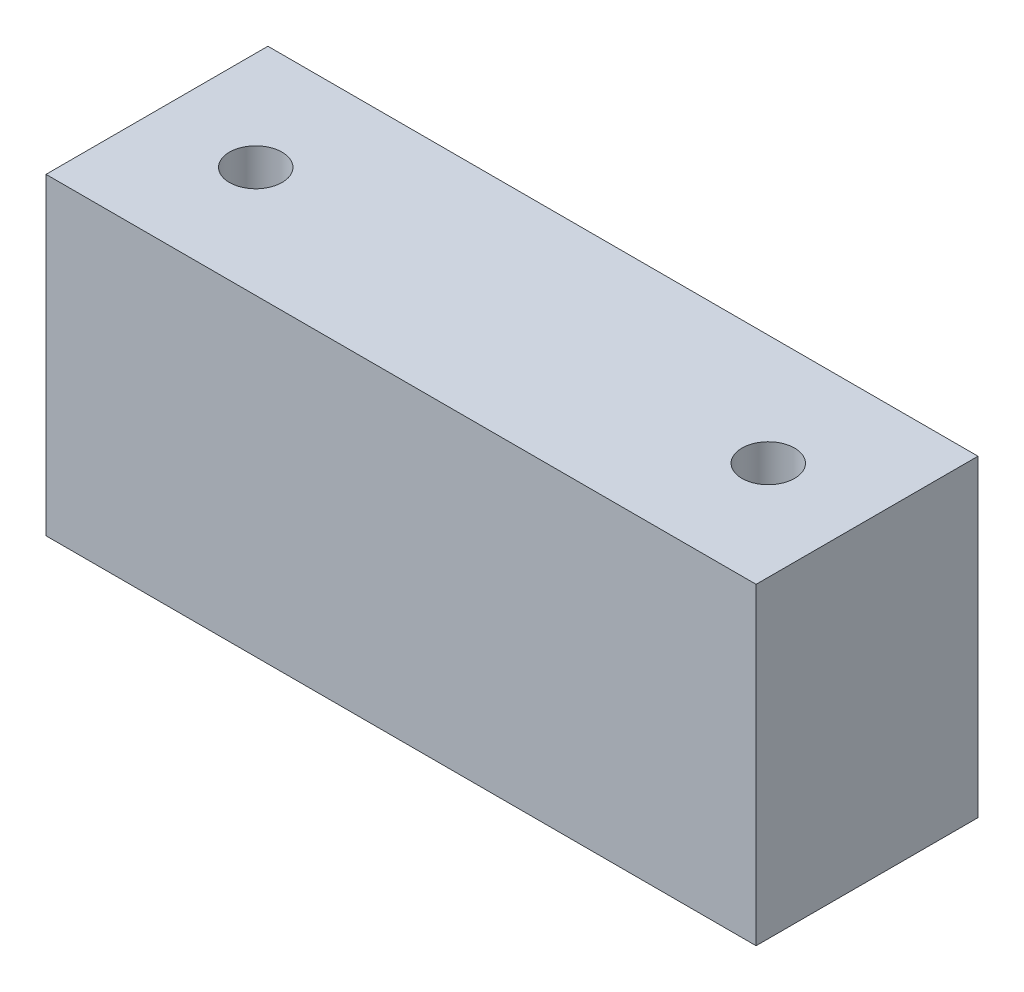
ISO-10303-21;
HEADER;
FILE_DESCRIPTION(('STEP AP214'),'2;1');
FILE_NAME('part.step','',(''),(''),'','','');
FILE_SCHEMA(('AUTOMOTIVE_DESIGN { 1 0 10303 214 1 1 1 1 }'));
ENDSEC;
DATA;
#1=APPLICATION_CONTEXT('core data for automotive mechanical design processes');
#2=APPLICATION_PROTOCOL_DEFINITION('international standard','automotive_design',2000,#1);
#3=PRODUCT_CONTEXT('',#1,'mechanical');
#4=PRODUCT('Part','Part','',(#3));
#5=PRODUCT_RELATED_PRODUCT_CATEGORY('part','',(#4));
#6=PRODUCT_DEFINITION_FORMATION('','',#4);
#7=PRODUCT_DEFINITION_CONTEXT('part definition',#1,'design');
#8=PRODUCT_DEFINITION('design','',#6,#7);
#9=PRODUCT_DEFINITION_SHAPE('','',#8);
#10=(LENGTH_UNIT() NAMED_UNIT(*) SI_UNIT(.MILLI.,.METRE.));
#11=(NAMED_UNIT(*) PLANE_ANGLE_UNIT() SI_UNIT($,.RADIAN.));
#12=(NAMED_UNIT(*) SI_UNIT($,.STERADIAN.) SOLID_ANGLE_UNIT());
#13=UNCERTAINTY_MEASURE_WITH_UNIT(LENGTH_MEASURE(1.E-05),#10,'distance_accuracy_value','');
#14=(GEOMETRIC_REPRESENTATION_CONTEXT(3) GLOBAL_UNCERTAINTY_ASSIGNED_CONTEXT((#13)) GLOBAL_UNIT_ASSIGNED_CONTEXT((#10,
#11,#12)) REPRESENTATION_CONTEXT('',''));
#15=CARTESIAN_POINT('',(0.,0.,0.));
#16=DIRECTION('',(0.,0.,1.));
#17=DIRECTION('',(1.,0.,0.));
#18=AXIS2_PLACEMENT_3D('',#15,#16,#17);
#19=CARTESIAN_POINT('',(15.24,13.4366,4.7625));
#20=DIRECTION('',(-1.,0.,0.));
#21=DIRECTION('',(0.,0.,1.));
#22=AXIS2_PLACEMENT_3D('',#19,#20,#21);
#23=PLANE('',#22);
#24=DIRECTION('',(0.,0.,-1.));
#25=VECTOR('',#24,1.);
#26=CARTESIAN_POINT('',(15.24,0.,4.7625));
#27=LINE('',#26,#25);
#28=CARTESIAN_POINT('',(15.24,0.,4.7625));
#29=VERTEX_POINT('',#28);
#30=CARTESIAN_POINT('',(15.24,0.,-4.7625));
#31=VERTEX_POINT('',#30);
#32=EDGE_CURVE('E111',#29,#31,#27,.T.);
#33=ORIENTED_EDGE('',*,*,#32,.T.);
#34=DIRECTION('',(0.,-1.,0.));
#35=VECTOR('',#34,1.);
#36=CARTESIAN_POINT('',(15.24,13.4366,-4.7625));
#37=LINE('',#36,#35);
#38=CARTESIAN_POINT('',(15.24,13.4366,-4.7625));
#39=VERTEX_POINT('',#38);
#40=EDGE_CURVE('E11',#39,#31,#37,.T.);
#41=ORIENTED_EDGE('',*,*,#40,.F.);
#42=DIRECTION('',(0.,0.,-1.));
#43=VECTOR('',#42,1.);
#44=CARTESIAN_POINT('',(15.24,13.4366,4.7625));
#45=LINE('',#44,#43);
#46=CARTESIAN_POINT('',(15.24,13.4366,4.7625));
#47=VERTEX_POINT('',#46);
#48=EDGE_CURVE('E95',#47,#39,#45,.T.);
#49=ORIENTED_EDGE('',*,*,#48,.F.);
#50=DIRECTION('',(0.,-1.,0.));
#51=VECTOR('',#50,1.);
#52=CARTESIAN_POINT('',(15.24,13.4366,4.7625));
#53=LINE('',#52,#51);
#54=EDGE_CURVE('E107',#47,#29,#53,.T.);
#55=ORIENTED_EDGE('',*,*,#54,.T.);
#56=EDGE_LOOP('',(#33,#41,#49,#55));
#57=FACE_BOUND('',#56,.T.);
#58=ADVANCED_FACE('F43',(#57),#23,.F.);
#59=CARTESIAN_POINT('',(-15.24,13.4366,-4.7625));
#60=DIRECTION('',(0.,0.,1.));
#61=DIRECTION('',(1.,0.,0.));
#62=AXIS2_PLACEMENT_3D('',#59,#60,#61);
#63=PLANE('',#62);
#64=DIRECTION('',(-1.,0.,0.));
#65=VECTOR('',#64,1.);
#66=CARTESIAN_POINT('',(-15.24,0.,-4.7625));
#67=LINE('',#66,#65);
#68=CARTESIAN_POINT('',(-15.24,0.,-4.7625));
#69=VERTEX_POINT('',#68);
#70=EDGE_CURVE('E100',#31,#69,#67,.T.);
#71=ORIENTED_EDGE('',*,*,#70,.T.);
#72=DIRECTION('',(0.,-1.,0.));
#73=VECTOR('',#72,1.);
#74=CARTESIAN_POINT('',(-15.24,13.4366,-4.7625));
#75=LINE('',#74,#73);
#76=CARTESIAN_POINT('',(-15.24,13.4366,-4.7625));
#77=VERTEX_POINT('',#76);
#78=EDGE_CURVE('E52',#77,#69,#75,.T.);
#79=ORIENTED_EDGE('',*,*,#78,.F.);
#80=DIRECTION('',(-1.,0.,0.));
#81=VECTOR('',#80,1.);
#82=CARTESIAN_POINT('',(-15.24,13.4366,-4.7625));
#83=LINE('',#82,#81);
#84=EDGE_CURVE('E90',#39,#77,#83,.T.);
#85=ORIENTED_EDGE('',*,*,#84,.F.);
#86=ORIENTED_EDGE('',*,*,#40,.T.);
#87=EDGE_LOOP('',(#71,#79,#85,#86));
#88=FACE_BOUND('',#87,.T.);
#89=ADVANCED_FACE('F99',(#88),#63,.F.);
#90=CARTESIAN_POINT('',(-15.24,13.4366,4.7625));
#91=DIRECTION('',(1.,0.,0.));
#92=DIRECTION('',(0.,0.,-1.));
#93=AXIS2_PLACEMENT_3D('',#90,#91,#92);
#94=PLANE('',#93);
#95=DIRECTION('',(0.,0.,1.));
#96=VECTOR('',#95,1.);
#97=CARTESIAN_POINT('',(-15.24,0.,4.7625));
#98=LINE('',#97,#96);
#99=CARTESIAN_POINT('',(-15.24,0.,4.7625));
#100=VERTEX_POINT('',#99);
#101=EDGE_CURVE('E77',#69,#100,#98,.T.);
#102=ORIENTED_EDGE('',*,*,#101,.T.);
#103=DIRECTION('',(0.,-1.,0.));
#104=VECTOR('',#103,1.);
#105=CARTESIAN_POINT('',(-15.24,13.4366,4.7625));
#106=LINE('',#105,#104);
#107=CARTESIAN_POINT('',(-15.24,13.4366,4.7625));
#108=VERTEX_POINT('',#107);
#109=EDGE_CURVE('E102',#108,#100,#106,.T.);
#110=ORIENTED_EDGE('',*,*,#109,.F.);
#111=DIRECTION('',(0.,0.,1.));
#112=VECTOR('',#111,1.);
#113=CARTESIAN_POINT('',(-15.24,13.4366,4.7625));
#114=LINE('',#113,#112);
#115=EDGE_CURVE('E93',#77,#108,#114,.T.);
#116=ORIENTED_EDGE('',*,*,#115,.F.);
#117=ORIENTED_EDGE('',*,*,#78,.T.);
#118=EDGE_LOOP('',(#102,#110,#116,#117));
#119=FACE_BOUND('',#118,.T.);
#120=ADVANCED_FACE('F103',(#119),#94,.F.);
#121=CARTESIAN_POINT('',(-15.24,13.4366,4.7625));
#122=DIRECTION('',(0.,0.,-1.));
#123=DIRECTION('',(-1.,0.,0.));
#124=AXIS2_PLACEMENT_3D('',#121,#122,#123);
#125=PLANE('',#124);
#126=DIRECTION('',(1.,0.,0.));
#127=VECTOR('',#126,1.);
#128=CARTESIAN_POINT('',(-15.24,0.,4.7625));
#129=LINE('',#128,#127);
#130=EDGE_CURVE('E83',#100,#29,#129,.T.);
#131=ORIENTED_EDGE('',*,*,#130,.T.);
#132=ORIENTED_EDGE('',*,*,#54,.F.);
#133=DIRECTION('',(1.,0.,0.));
#134=VECTOR('',#133,1.);
#135=CARTESIAN_POINT('',(-15.24,13.4366,4.7625));
#136=LINE('',#135,#134);
#137=EDGE_CURVE('E60',#108,#47,#136,.T.);
#138=ORIENTED_EDGE('',*,*,#137,.F.);
#139=ORIENTED_EDGE('',*,*,#109,.T.);
#140=EDGE_LOOP('',(#131,#132,#138,#139));
#141=FACE_BOUND('',#140,.T.);
#142=ADVANCED_FACE('F125',(#141),#125,.F.);
#143=CARTESIAN_POINT('',(0.,13.4366,0.));
#144=DIRECTION('',(0.,-1.,0.));
#145=DIRECTION('',(0.,0.,-1.));
#146=AXIS2_PLACEMENT_3D('',#143,#144,#145);
#147=PLANE('',#146);
#148=CARTESIAN_POINT('',(-11.,13.4366,0.));
#149=DIRECTION('',(0.,1.,0.));
#150=DIRECTION('',(0.,0.,1.));
#151=AXIS2_PLACEMENT_3D('',#148,#149,#150);
#152=CIRCLE('',#151,1.1303);
#153=CARTESIAN_POINT('',(-11.,13.4366,1.1303));
#154=VERTEX_POINT('',#153);
#155=EDGE_CURVE('E140',#154,#154,#152,.T.);
#156=ORIENTED_EDGE('',*,*,#155,.F.);
#157=EDGE_LOOP('',(#156));
#158=FACE_BOUND('',#157,.T.);
#159=CARTESIAN_POINT('',(11.,13.4366,0.));
#160=DIRECTION('',(0.,1.,0.));
#161=DIRECTION('',(0.,0.,1.));
#162=AXIS2_PLACEMENT_3D('',#159,#160,#161);
#163=CIRCLE('',#162,1.1303);
#164=CARTESIAN_POINT('',(11.,13.4366,1.1303));
#165=VERTEX_POINT('',#164);
#166=EDGE_CURVE('E136',#165,#165,#163,.T.);
#167=ORIENTED_EDGE('',*,*,#166,.F.);
#168=EDGE_LOOP('',(#167));
#169=FACE_BOUND('',#168,.T.);
#170=ORIENTED_EDGE('',*,*,#48,.T.);
#171=ORIENTED_EDGE('',*,*,#84,.T.);
#172=ORIENTED_EDGE('',*,*,#115,.T.);
#173=ORIENTED_EDGE('',*,*,#137,.T.);
#174=EDGE_LOOP('',(#170,#171,#172,#173));
#175=FACE_BOUND('',#174,.T.);
#176=ADVANCED_FACE('F91',(#158,#169,#175),#147,.F.);
#177=CARTESIAN_POINT('',(0.,0.,0.));
#178=DIRECTION('',(0.,-1.,0.));
#179=DIRECTION('',(0.,0.,-1.));
#180=AXIS2_PLACEMENT_3D('',#177,#178,#179);
#181=PLANE('',#180);
#182=CARTESIAN_POINT('',(-11.,0.,0.));
#183=DIRECTION('',(0.,1.,0.));
#184=DIRECTION('',(0.,0.,1.));
#185=AXIS2_PLACEMENT_3D('',#182,#183,#184);
#186=CIRCLE('',#185,1.1303);
#187=CARTESIAN_POINT('',(-11.,0.,1.1303));
#188=VERTEX_POINT('',#187);
#189=EDGE_CURVE('E115',#188,#188,#186,.T.);
#190=ORIENTED_EDGE('',*,*,#189,.T.);
#191=EDGE_LOOP('',(#190));
#192=FACE_BOUND('',#191,.T.);
#193=CARTESIAN_POINT('',(11.,0.,0.));
#194=DIRECTION('',(0.,1.,0.));
#195=DIRECTION('',(0.,0.,1.));
#196=AXIS2_PLACEMENT_3D('',#193,#194,#195);
#197=CIRCLE('',#196,1.1303);
#198=CARTESIAN_POINT('',(11.,0.,1.1303));
#199=VERTEX_POINT('',#198);
#200=EDGE_CURVE('E132',#199,#199,#197,.T.);
#201=ORIENTED_EDGE('',*,*,#200,.T.);
#202=EDGE_LOOP('',(#201));
#203=FACE_BOUND('',#202,.T.);
#204=ORIENTED_EDGE('',*,*,#32,.F.);
#205=ORIENTED_EDGE('',*,*,#130,.F.);
#206=ORIENTED_EDGE('',*,*,#101,.F.);
#207=ORIENTED_EDGE('',*,*,#70,.F.);
#208=EDGE_LOOP('',(#204,#205,#206,#207));
#209=FACE_BOUND('',#208,.T.);
#210=ADVANCED_FACE('F128',(#192,#203,#209),#181,.T.);
#211=CARTESIAN_POINT('',(11.,0.,0.));
#212=DIRECTION('',(0.,1.,0.));
#213=DIRECTION('',(0.,0.,1.));
#214=AXIS2_PLACEMENT_3D('',#211,#212,#213);
#215=CYLINDRICAL_SURFACE('',#214,1.1303);
#216=ORIENTED_EDGE('',*,*,#200,.F.);
#217=EDGE_LOOP('',(#216));
#218=FACE_BOUND('',#217,.T.);
#219=ORIENTED_EDGE('',*,*,#166,.T.);
#220=EDGE_LOOP('',(#219));
#221=FACE_BOUND('',#220,.T.);
#222=ADVANCED_FACE('F153',(#218,#221),#215,.F.);
#223=CARTESIAN_POINT('',(-11.,0.,0.));
#224=DIRECTION('',(0.,1.,0.));
#225=DIRECTION('',(0.,0.,1.));
#226=AXIS2_PLACEMENT_3D('',#223,#224,#225);
#227=CYLINDRICAL_SURFACE('',#226,1.1303);
#228=ORIENTED_EDGE('',*,*,#189,.F.);
#229=EDGE_LOOP('',(#228));
#230=FACE_BOUND('',#229,.T.);
#231=ORIENTED_EDGE('',*,*,#155,.T.);
#232=EDGE_LOOP('',(#231));
#233=FACE_BOUND('',#232,.T.);
#234=ADVANCED_FACE('F150',(#230,#233),#227,.F.);
#235=CLOSED_SHELL('',(#58,#89,#120,#142,#176,#210,#222,#234));
#236=MANIFOLD_SOLID_BREP('B2',#235);
#237=ADVANCED_BREP_SHAPE_REPRESENTATION('',(#18,#236),#14);
#238=SHAPE_DEFINITION_REPRESENTATION(#9,#237);
ENDSEC;
END-ISO-10303-21;
